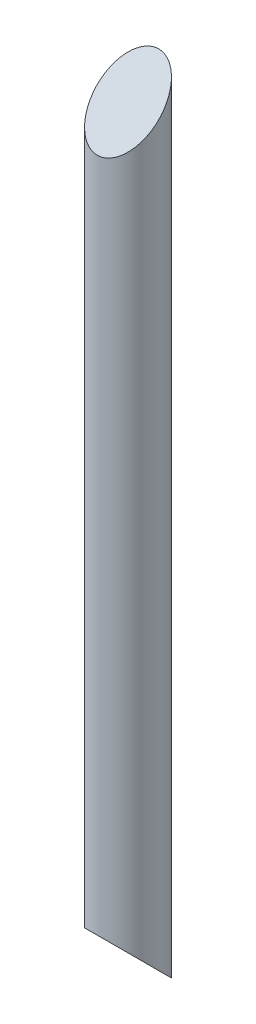
ISO-10303-21;
HEADER;
FILE_DESCRIPTION(('STEP AP214'),'2;1');
FILE_NAME('part.step','',(''),(''),'','','');
FILE_SCHEMA(('AUTOMOTIVE_DESIGN { 1 0 10303 214 1 1 1 1 }'));
ENDSEC;
DATA;
#1=APPLICATION_CONTEXT('core data for automotive mechanical design processes');
#2=APPLICATION_PROTOCOL_DEFINITION('international standard','automotive_design',2000,#1);
#3=PRODUCT_CONTEXT('',#1,'mechanical');
#4=PRODUCT('Part','Part','',(#3));
#5=PRODUCT_RELATED_PRODUCT_CATEGORY('part','',(#4));
#6=PRODUCT_DEFINITION_FORMATION('','',#4);
#7=PRODUCT_DEFINITION_CONTEXT('part definition',#1,'design');
#8=PRODUCT_DEFINITION('design','',#6,#7);
#9=PRODUCT_DEFINITION_SHAPE('','',#8);
#10=(LENGTH_UNIT() NAMED_UNIT(*) SI_UNIT(.MILLI.,.METRE.));
#11=(NAMED_UNIT(*) PLANE_ANGLE_UNIT() SI_UNIT($,.RADIAN.));
#12=(NAMED_UNIT(*) SI_UNIT($,.STERADIAN.) SOLID_ANGLE_UNIT());
#13=UNCERTAINTY_MEASURE_WITH_UNIT(LENGTH_MEASURE(1.E-05),#10,'distance_accuracy_value','');
#14=(GEOMETRIC_REPRESENTATION_CONTEXT(3) GLOBAL_UNCERTAINTY_ASSIGNED_CONTEXT((#13)) GLOBAL_UNIT_ASSIGNED_CONTEXT((#10,
#11,#12)) REPRESENTATION_CONTEXT('',''));
#15=CARTESIAN_POINT('',(0.,0.,0.));
#16=DIRECTION('',(0.,0.,1.));
#17=DIRECTION('',(1.,0.,0.));
#18=AXIS2_PLACEMENT_3D('',#15,#16,#17);
#19=CARTESIAN_POINT('',(0.,698.5,0.));
#20=DIRECTION('',(0.,-1.,0.));
#21=DIRECTION('',(0.,0.,-1.));
#22=AXIS2_PLACEMENT_3D('',#19,#20,#21);
#23=CYLINDRICAL_SURFACE('',#22,31.75);
#24=CARTESIAN_POINT('',(0.,-31.7500000000001,0.));
#25=DIRECTION('',(0.,-0.707106781186548,0.707106781186548));
#26=DIRECTION('',(0.,-0.707106781186548,-0.707106781186548));
#27=AXIS2_PLACEMENT_3D('',#24,#25,#26);
#28=ELLIPSE('',#27,44.9012806053458,31.75);
#29=CARTESIAN_POINT('',(0.,-63.5000000000001,-31.75));
#30=VERTEX_POINT('',#29);
#31=EDGE_CURVE('E36',#30,#30,#28,.T.);
#32=ORIENTED_EDGE('',*,*,#31,.F.);
#33=EDGE_LOOP('',(#32));
#34=FACE_BOUND('',#33,.T.);
#35=CARTESIAN_POINT('',(0.,730.25,0.));
#36=DIRECTION('',(0.,-0.707106781186548,-0.707106781186548));
#37=DIRECTION('',(0.,-0.707106781186548,0.707106781186548));
#38=AXIS2_PLACEMENT_3D('',#35,#36,#37);
#39=ELLIPSE('',#38,44.9012806053458,31.75);
#40=CARTESIAN_POINT('',(0.,698.5,31.75));
#41=VERTEX_POINT('',#40);
#42=EDGE_CURVE('E10',#41,#41,#39,.T.);
#43=ORIENTED_EDGE('',*,*,#42,.T.);
#44=EDGE_LOOP('',(#43));
#45=FACE_BOUND('',#44,.T.);
#46=ADVANCED_FACE('F30',(#34,#45),#23,.T.);
#47=CARTESIAN_POINT('',(-31.75,-15.875,15.875));
#48=DIRECTION('',(0.,-0.707106781186548,0.707106781186548));
#49=DIRECTION('',(0.,-0.707106781186548,-0.707106781186548));
#50=AXIS2_PLACEMENT_3D('',#47,#48,#49);
#51=PLANE('',#50);
#52=ORIENTED_EDGE('',*,*,#31,.T.);
#53=EDGE_LOOP('',(#52));
#54=FACE_BOUND('',#53,.T.);
#55=ADVANCED_FACE('F42',(#54),#51,.T.);
#56=CARTESIAN_POINT('',(-31.75,365.125,365.125));
#57=DIRECTION('',(0.,-0.707106781186548,-0.707106781186548));
#58=DIRECTION('',(0.,0.707106781186548,-0.707106781186548));
#59=AXIS2_PLACEMENT_3D('',#56,#57,#58);
#60=PLANE('',#59);
#61=ORIENTED_EDGE('',*,*,#42,.F.);
#62=EDGE_LOOP('',(#61));
#63=FACE_BOUND('',#62,.T.);
#64=ADVANCED_FACE('F48',(#63),#60,.F.);
#65=CLOSED_SHELL('',(#46,#55,#64));
#66=MANIFOLD_SOLID_BREP('B2',#65);
#67=ADVANCED_BREP_SHAPE_REPRESENTATION('',(#18,#66),#14);
#68=SHAPE_DEFINITION_REPRESENTATION(#9,#67);
ENDSEC;
END-ISO-10303-21;
